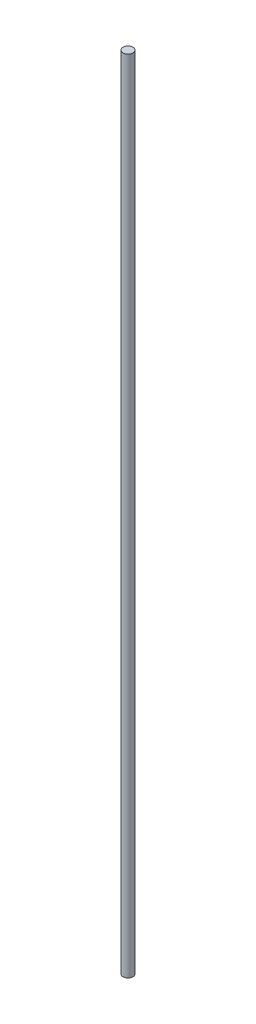
ISO-10303-21;
HEADER;
FILE_DESCRIPTION(('STEP AP214'),'2;1');
FILE_NAME('part.step','',(''),(''),'','','');
FILE_SCHEMA(('AUTOMOTIVE_DESIGN { 1 0 10303 214 1 1 1 1 }'));
ENDSEC;
DATA;
#1=APPLICATION_CONTEXT('core data for automotive mechanical design processes');
#2=APPLICATION_PROTOCOL_DEFINITION('international standard','automotive_design',2000,#1);
#3=PRODUCT_CONTEXT('',#1,'mechanical');
#4=PRODUCT('Part','Part','',(#3));
#5=PRODUCT_RELATED_PRODUCT_CATEGORY('part','',(#4));
#6=PRODUCT_DEFINITION_FORMATION('','',#4);
#7=PRODUCT_DEFINITION_CONTEXT('part definition',#1,'design');
#8=PRODUCT_DEFINITION('design','',#6,#7);
#9=PRODUCT_DEFINITION_SHAPE('','',#8);
#10=(LENGTH_UNIT() NAMED_UNIT(*) SI_UNIT(.MILLI.,.METRE.));
#11=(NAMED_UNIT(*) PLANE_ANGLE_UNIT() SI_UNIT($,.RADIAN.));
#12=(NAMED_UNIT(*) SI_UNIT($,.STERADIAN.) SOLID_ANGLE_UNIT());
#13=UNCERTAINTY_MEASURE_WITH_UNIT(LENGTH_MEASURE(1.E-05),#10,'distance_accuracy_value','');
#14=(GEOMETRIC_REPRESENTATION_CONTEXT(3) GLOBAL_UNCERTAINTY_ASSIGNED_CONTEXT((#13)) GLOBAL_UNIT_ASSIGNED_CONTEXT((#10,
#11,#12)) REPRESENTATION_CONTEXT('',''));
#15=CARTESIAN_POINT('',(0.,0.,0.));
#16=DIRECTION('',(0.,0.,1.));
#17=DIRECTION('',(1.,0.,0.));
#18=AXIS2_PLACEMENT_3D('',#15,#16,#17);
#19=CARTESIAN_POINT('',(-5.10702591327572E-12,820.420000000004,4.44089209850063E-13));
#20=DIRECTION('',(0.,-1.,0.));
#21=DIRECTION('',(0.,0.,-0.999999999999998));
#22=AXIS2_PLACEMENT_3D('',#19,#20,#21);
#23=CYLINDRICAL_SURFACE('',#22,5.08);
#24=CARTESIAN_POINT('',(-5.10702591327572E-12,820.420000000004,4.44089209850063E-13));
#25=DIRECTION('',(0.,1.,0.));
#26=DIRECTION('',(0.,0.,0.999999999999998));
#27=AXIS2_PLACEMENT_3D('',#24,#25,#26);
#28=CIRCLE('',#27,5.08);
#29=CARTESIAN_POINT('',(-5.09997599706935E-12,820.420000000004,5.08000000000044));
#30=VERTEX_POINT('',#29);
#31=EDGE_CURVE('E12',#30,#30,#28,.T.);
#32=ORIENTED_EDGE('',*,*,#31,.F.);
#33=EDGE_LOOP('',(#32));
#34=FACE_BOUND('',#33,.T.);
#35=CARTESIAN_POINT('',(0.,0.,0.));
#36=DIRECTION('',(0.,1.,0.));
#37=DIRECTION('',(0.,0.,0.999999999999998));
#38=AXIS2_PLACEMENT_3D('',#35,#36,#37);
#39=CIRCLE('',#38,5.08);
#40=CARTESIAN_POINT('',(0.,0.,5.07999999999999));
#41=VERTEX_POINT('',#40);
#42=EDGE_CURVE('E47',#41,#41,#39,.T.);
#43=ORIENTED_EDGE('',*,*,#42,.T.);
#44=EDGE_LOOP('',(#43));
#45=FACE_BOUND('',#44,.T.);
#46=ADVANCED_FACE('F44',(#34,#45),#23,.T.);
#47=CARTESIAN_POINT('',(-5.10702591327572E-12,820.420000000004,4.44089209850063E-13));
#48=DIRECTION('',(0.,1.,0.));
#49=DIRECTION('',(0.,0.,0.999999999999998));
#50=AXIS2_PLACEMENT_3D('',#47,#48,#49);
#51=PLANE('',#50);
#52=ORIENTED_EDGE('',*,*,#31,.T.);
#53=EDGE_LOOP('',(#52));
#54=FACE_BOUND('',#53,.T.);
#55=ADVANCED_FACE('F59',(#54),#51,.T.);
#56=CARTESIAN_POINT('',(0.,0.,0.));
#57=DIRECTION('',(0.,1.,0.));
#58=DIRECTION('',(0.,0.,0.999999999999998));
#59=AXIS2_PLACEMENT_3D('',#56,#57,#58);
#60=PLANE('',#59);
#61=ORIENTED_EDGE('',*,*,#42,.F.);
#62=EDGE_LOOP('',(#61));
#63=FACE_BOUND('',#62,.T.);
#64=ADVANCED_FACE('F57',(#63),#60,.F.);
#65=CLOSED_SHELL('',(#46,#55,#64));
#66=MANIFOLD_SOLID_BREP('B2',#65);
#67=ADVANCED_BREP_SHAPE_REPRESENTATION('',(#18,#66),#14);
#68=SHAPE_DEFINITION_REPRESENTATION(#9,#67);
ENDSEC;
END-ISO-10303-21;
